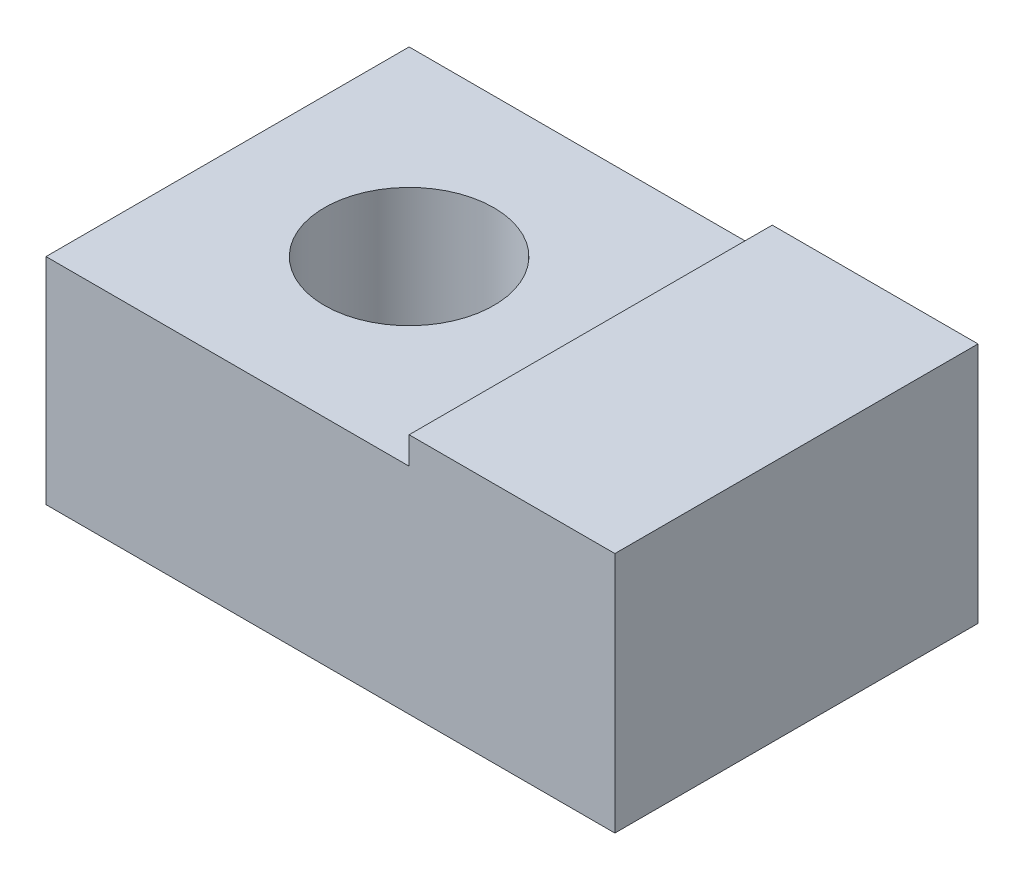
ISO-10303-21;
HEADER;
FILE_DESCRIPTION(('STEP AP214'),'2;1');
FILE_NAME('part.step','',(''),(''),'','','');
FILE_SCHEMA(('AUTOMOTIVE_DESIGN { 1 0 10303 214 1 1 1 1 }'));
ENDSEC;
DATA;
#1=APPLICATION_CONTEXT('core data for automotive mechanical design processes');
#2=APPLICATION_PROTOCOL_DEFINITION('international standard','automotive_design',2000,#1);
#3=PRODUCT_CONTEXT('',#1,'mechanical');
#4=PRODUCT('Part','Part','',(#3));
#5=PRODUCT_RELATED_PRODUCT_CATEGORY('part','',(#4));
#6=PRODUCT_DEFINITION_FORMATION('','',#4);
#7=PRODUCT_DEFINITION_CONTEXT('part definition',#1,'design');
#8=PRODUCT_DEFINITION('design','',#6,#7);
#9=PRODUCT_DEFINITION_SHAPE('','',#8);
#10=(LENGTH_UNIT() NAMED_UNIT(*) SI_UNIT(.MILLI.,.METRE.));
#11=(NAMED_UNIT(*) PLANE_ANGLE_UNIT() SI_UNIT($,.RADIAN.));
#12=(NAMED_UNIT(*) SI_UNIT($,.STERADIAN.) SOLID_ANGLE_UNIT());
#13=UNCERTAINTY_MEASURE_WITH_UNIT(LENGTH_MEASURE(1.E-05),#10,'distance_accuracy_value','');
#14=(GEOMETRIC_REPRESENTATION_CONTEXT(3) GLOBAL_UNCERTAINTY_ASSIGNED_CONTEXT((#13)) GLOBAL_UNIT_ASSIGNED_CONTEXT((#10,
#11,#12)) REPRESENTATION_CONTEXT('',''));
#15=CARTESIAN_POINT('',(0.,0.,0.));
#16=DIRECTION('',(0.,0.,1.));
#17=DIRECTION('',(1.,0.,0.));
#18=AXIS2_PLACEMENT_3D('',#15,#16,#17);
#19=CARTESIAN_POINT('',(13.,35.5,30.));
#20=DIRECTION('',(1.,0.,0.));
#21=DIRECTION('',(0.,0.,-1.));
#22=AXIS2_PLACEMENT_3D('',#19,#20,#21);
#23=PLANE('',#22);
#24=DIRECTION('',(0.,0.,-1.));
#25=VECTOR('',#24,1.);
#26=CARTESIAN_POINT('',(13.,35.5,30.));
#27=LINE('',#26,#25);
#28=CARTESIAN_POINT('',(13.,35.5,-30.));
#29=VERTEX_POINT('',#28);
#30=CARTESIAN_POINT('',(13.,35.5,30.));
#31=VERTEX_POINT('',#30);
#32=EDGE_CURVE('E91',#29,#31,#27,.F.);
#33=ORIENTED_EDGE('',*,*,#32,.T.);
#34=DIRECTION('',(0.,1.,0.));
#35=VECTOR('',#34,1.);
#36=CARTESIAN_POINT('',(13.,0.,30.));
#37=LINE('',#36,#35);
#38=CARTESIAN_POINT('',(13.,40.,30.));
#39=VERTEX_POINT('',#38);
#40=EDGE_CURVE('E98',#39,#31,#37,.F.);
#41=ORIENTED_EDGE('',*,*,#40,.F.);
#42=DIRECTION('',(0.,0.,1.));
#43=VECTOR('',#42,1.);
#44=CARTESIAN_POINT('',(13.,40.,0.));
#45=LINE('',#44,#43);
#46=CARTESIAN_POINT('',(13.,40.,-30.));
#47=VERTEX_POINT('',#46);
#48=EDGE_CURVE('E74',#47,#39,#45,.T.);
#49=ORIENTED_EDGE('',*,*,#48,.F.);
#50=DIRECTION('',(0.,1.,0.));
#51=VECTOR('',#50,1.);
#52=CARTESIAN_POINT('',(13.,0.,-30.));
#53=LINE('',#52,#51);
#54=EDGE_CURVE('E113',#29,#47,#53,.T.);
#55=ORIENTED_EDGE('',*,*,#54,.F.);
#56=EDGE_LOOP('',(#33,#41,#49,#55));
#57=FACE_BOUND('',#56,.T.);
#58=ADVANCED_FACE('F24',(#57),#23,.F.);
#59=CARTESIAN_POINT('',(0.,40.,0.));
#60=DIRECTION('',(0.,1.,0.));
#61=DIRECTION('',(0.,0.,1.));
#62=AXIS2_PLACEMENT_3D('',#59,#60,#61);
#63=PLANE('',#62);
#64=DIRECTION('',(-1.,0.,0.));
#65=VECTOR('',#64,1.);
#66=CARTESIAN_POINT('',(47.,40.,-30.));
#67=LINE('',#66,#65);
#68=CARTESIAN_POINT('',(47.,40.,-30.));
#69=VERTEX_POINT('',#68);
#70=EDGE_CURVE('E123',#47,#69,#67,.F.);
#71=ORIENTED_EDGE('',*,*,#70,.F.);
#72=ORIENTED_EDGE('',*,*,#48,.T.);
#73=DIRECTION('',(1.,0.,0.));
#74=VECTOR('',#73,1.);
#75=CARTESIAN_POINT('',(-47.,40.,30.));
#76=LINE('',#75,#74);
#77=CARTESIAN_POINT('',(47.,40.,30.));
#78=VERTEX_POINT('',#77);
#79=EDGE_CURVE('E105',#78,#39,#76,.F.);
#80=ORIENTED_EDGE('',*,*,#79,.F.);
#81=DIRECTION('',(0.,0.,-1.));
#82=VECTOR('',#81,1.);
#83=CARTESIAN_POINT('',(47.,40.,30.));
#84=LINE('',#83,#82);
#85=EDGE_CURVE('E100',#69,#78,#84,.F.);
#86=ORIENTED_EDGE('',*,*,#85,.F.);
#87=EDGE_LOOP('',(#71,#72,#80,#86));
#88=FACE_BOUND('',#87,.T.);
#89=ADVANCED_FACE('F134',(#88),#63,.T.);
#90=CARTESIAN_POINT('',(-47.,35.5,30.));
#91=DIRECTION('',(0.,-1.,0.));
#92=DIRECTION('',(0.,0.,-1.));
#93=AXIS2_PLACEMENT_3D('',#90,#91,#92);
#94=PLANE('',#93);
#95=CARTESIAN_POINT('',(-17.,35.5,0.));
#96=DIRECTION('',(0.,1.,0.));
#97=DIRECTION('',(0.,0.,1.));
#98=AXIS2_PLACEMENT_3D('',#95,#96,#97);
#99=CIRCLE('',#98,14.);
#100=CARTESIAN_POINT('',(-17.,35.5,14.));
#101=VERTEX_POINT('',#100);
#102=EDGE_CURVE('E27',#101,#101,#99,.F.);
#103=ORIENTED_EDGE('',*,*,#102,.T.);
#104=EDGE_LOOP('',(#103));
#105=FACE_BOUND('',#104,.T.);
#106=ORIENTED_EDGE('',*,*,#32,.F.);
#107=DIRECTION('',(-1.,0.,0.));
#108=VECTOR('',#107,1.);
#109=CARTESIAN_POINT('',(47.,35.5,-30.));
#110=LINE('',#109,#108);
#111=CARTESIAN_POINT('',(-47.,35.5,-30.));
#112=VERTEX_POINT('',#111);
#113=EDGE_CURVE('E85',#112,#29,#110,.F.);
#114=ORIENTED_EDGE('',*,*,#113,.F.);
#115=DIRECTION('',(0.,0.,1.));
#116=VECTOR('',#115,1.);
#117=CARTESIAN_POINT('',(-47.,35.5,-30.));
#118=LINE('',#117,#116);
#119=CARTESIAN_POINT('',(-47.,35.5,30.));
#120=VERTEX_POINT('',#119);
#121=EDGE_CURVE('E80',#120,#112,#118,.F.);
#122=ORIENTED_EDGE('',*,*,#121,.F.);
#123=DIRECTION('',(1.,0.,0.));
#124=VECTOR('',#123,1.);
#125=CARTESIAN_POINT('',(-47.,35.5,30.));
#126=LINE('',#125,#124);
#127=EDGE_CURVE('E83',#31,#120,#126,.F.);
#128=ORIENTED_EDGE('',*,*,#127,.F.);
#129=EDGE_LOOP('',(#106,#114,#122,#128));
#130=FACE_BOUND('',#129,.T.);
#131=ADVANCED_FACE('F82',(#105,#130),#94,.F.);
#132=CARTESIAN_POINT('',(-47.,0.,-30.));
#133=DIRECTION('',(-1.,0.,0.));
#134=DIRECTION('',(0.,0.,1.));
#135=AXIS2_PLACEMENT_3D('',#132,#133,#134);
#136=PLANE('',#135);
#137=DIRECTION('',(0.,1.,0.));
#138=VECTOR('',#137,1.);
#139=CARTESIAN_POINT('',(-47.,0.,30.));
#140=LINE('',#139,#138);
#141=CARTESIAN_POINT('',(-47.,0.,30.));
#142=VERTEX_POINT('',#141);
#143=EDGE_CURVE('E90',#120,#142,#140,.F.);
#144=ORIENTED_EDGE('',*,*,#143,.F.);
#145=ORIENTED_EDGE('',*,*,#121,.T.);
#146=DIRECTION('',(0.,1.,0.));
#147=VECTOR('',#146,1.);
#148=CARTESIAN_POINT('',(-47.,0.,-30.));
#149=LINE('',#148,#147);
#150=CARTESIAN_POINT('',(-47.,0.,-30.));
#151=VERTEX_POINT('',#150);
#152=EDGE_CURVE('E115',#151,#112,#149,.T.);
#153=ORIENTED_EDGE('',*,*,#152,.F.);
#154=DIRECTION('',(0.,0.,1.));
#155=VECTOR('',#154,1.);
#156=CARTESIAN_POINT('',(-47.,0.,0.));
#157=LINE('',#156,#155);
#158=EDGE_CURVE('E104',#151,#142,#157,.T.);
#159=ORIENTED_EDGE('',*,*,#158,.T.);
#160=EDGE_LOOP('',(#144,#145,#153,#159));
#161=FACE_BOUND('',#160,.T.);
#162=ADVANCED_FACE('F103',(#161),#136,.T.);
#163=CARTESIAN_POINT('',(-47.,0.,30.));
#164=DIRECTION('',(0.,0.,1.));
#165=DIRECTION('',(1.,0.,0.));
#166=AXIS2_PLACEMENT_3D('',#163,#164,#165);
#167=PLANE('',#166);
#168=ORIENTED_EDGE('',*,*,#40,.T.);
#169=ORIENTED_EDGE('',*,*,#127,.T.);
#170=ORIENTED_EDGE('',*,*,#143,.T.);
#171=DIRECTION('',(1.,0.,0.));
#172=VECTOR('',#171,1.);
#173=CARTESIAN_POINT('',(0.,0.,30.));
#174=LINE('',#173,#172);
#175=CARTESIAN_POINT('',(47.,0.,30.));
#176=VERTEX_POINT('',#175);
#177=EDGE_CURVE('E135',#142,#176,#174,.T.);
#178=ORIENTED_EDGE('',*,*,#177,.T.);
#179=DIRECTION('',(0.,1.,0.));
#180=VECTOR('',#179,1.);
#181=CARTESIAN_POINT('',(47.,0.,30.));
#182=LINE('',#181,#180);
#183=EDGE_CURVE('E126',#78,#176,#182,.F.);
#184=ORIENTED_EDGE('',*,*,#183,.F.);
#185=ORIENTED_EDGE('',*,*,#79,.T.);
#186=EDGE_LOOP('',(#168,#169,#170,#178,#184,#185));
#187=FACE_BOUND('',#186,.T.);
#188=ADVANCED_FACE('F94',(#187),#167,.T.);
#189=CARTESIAN_POINT('',(47.,0.,30.));
#190=DIRECTION('',(1.,0.,0.));
#191=DIRECTION('',(0.,0.,-1.));
#192=AXIS2_PLACEMENT_3D('',#189,#190,#191);
#193=PLANE('',#192);
#194=ORIENTED_EDGE('',*,*,#183,.T.);
#195=DIRECTION('',(0.,0.,1.));
#196=VECTOR('',#195,1.);
#197=CARTESIAN_POINT('',(47.,0.,0.));
#198=LINE('',#197,#196);
#199=CARTESIAN_POINT('',(47.,0.,-30.));
#200=VERTEX_POINT('',#199);
#201=EDGE_CURVE('E137',#176,#200,#198,.F.);
#202=ORIENTED_EDGE('',*,*,#201,.T.);
#203=DIRECTION('',(0.,1.,0.));
#204=VECTOR('',#203,1.);
#205=CARTESIAN_POINT('',(47.,0.,-30.));
#206=LINE('',#205,#204);
#207=EDGE_CURVE('E41',#69,#200,#206,.F.);
#208=ORIENTED_EDGE('',*,*,#207,.F.);
#209=ORIENTED_EDGE('',*,*,#85,.T.);
#210=EDGE_LOOP('',(#194,#202,#208,#209));
#211=FACE_BOUND('',#210,.T.);
#212=ADVANCED_FACE('F130',(#211),#193,.T.);
#213=CARTESIAN_POINT('',(47.,0.,-30.));
#214=DIRECTION('',(0.,0.,-1.));
#215=DIRECTION('',(-1.,0.,0.));
#216=AXIS2_PLACEMENT_3D('',#213,#214,#215);
#217=PLANE('',#216);
#218=ORIENTED_EDGE('',*,*,#152,.T.);
#219=ORIENTED_EDGE('',*,*,#113,.T.);
#220=ORIENTED_EDGE('',*,*,#54,.T.);
#221=ORIENTED_EDGE('',*,*,#70,.T.);
#222=ORIENTED_EDGE('',*,*,#207,.T.);
#223=DIRECTION('',(1.,0.,0.));
#224=VECTOR('',#223,1.);
#225=CARTESIAN_POINT('',(0.,0.,-30.));
#226=LINE('',#225,#224);
#227=EDGE_CURVE('E33',#200,#151,#226,.F.);
#228=ORIENTED_EDGE('',*,*,#227,.T.);
#229=EDGE_LOOP('',(#218,#219,#220,#221,#222,#228));
#230=FACE_BOUND('',#229,.T.);
#231=ADVANCED_FACE('F114',(#230),#217,.T.);
#232=CARTESIAN_POINT('',(-17.,-86.0063121584,0.));
#233=DIRECTION('',(0.,1.,0.));
#234=DIRECTION('',(0.,0.,1.));
#235=AXIS2_PLACEMENT_3D('',#232,#233,#234);
#236=CYLINDRICAL_SURFACE('',#235,14.);
#237=CARTESIAN_POINT('',(-17.,0.,0.));
#238=DIRECTION('',(0.,1.,0.));
#239=DIRECTION('',(0.,0.,1.));
#240=AXIS2_PLACEMENT_3D('',#237,#238,#239);
#241=CIRCLE('',#240,14.);
#242=CARTESIAN_POINT('',(-17.,0.,14.));
#243=VERTEX_POINT('',#242);
#244=EDGE_CURVE('E13',#243,#243,#241,.F.);
#245=ORIENTED_EDGE('',*,*,#244,.T.);
#246=EDGE_LOOP('',(#245));
#247=FACE_BOUND('',#246,.T.);
#248=ORIENTED_EDGE('',*,*,#102,.F.);
#249=EDGE_LOOP('',(#248));
#250=FACE_BOUND('',#249,.T.);
#251=ADVANCED_FACE('F142',(#247,#250),#236,.F.);
#252=CARTESIAN_POINT('',(0.,0.,0.));
#253=DIRECTION('',(0.,1.,0.));
#254=DIRECTION('',(0.,0.,1.));
#255=AXIS2_PLACEMENT_3D('',#252,#253,#254);
#256=PLANE('',#255);
#257=ORIENTED_EDGE('',*,*,#244,.F.);
#258=EDGE_LOOP('',(#257));
#259=FACE_BOUND('',#258,.T.);
#260=ORIENTED_EDGE('',*,*,#201,.F.);
#261=ORIENTED_EDGE('',*,*,#177,.F.);
#262=ORIENTED_EDGE('',*,*,#158,.F.);
#263=ORIENTED_EDGE('',*,*,#227,.F.);
#264=EDGE_LOOP('',(#260,#261,#262,#263));
#265=FACE_BOUND('',#264,.T.);
#266=ADVANCED_FACE('F140',(#259,#265),#256,.F.);
#267=CLOSED_SHELL('',(#58,#89,#131,#162,#188,#212,#231,#251,#266));
#268=MANIFOLD_SOLID_BREP('B1',#267);
#269=ADVANCED_BREP_SHAPE_REPRESENTATION('',(#18,#268),#14);
#270=SHAPE_DEFINITION_REPRESENTATION(#9,#269);
ENDSEC;
END-ISO-10303-21;
